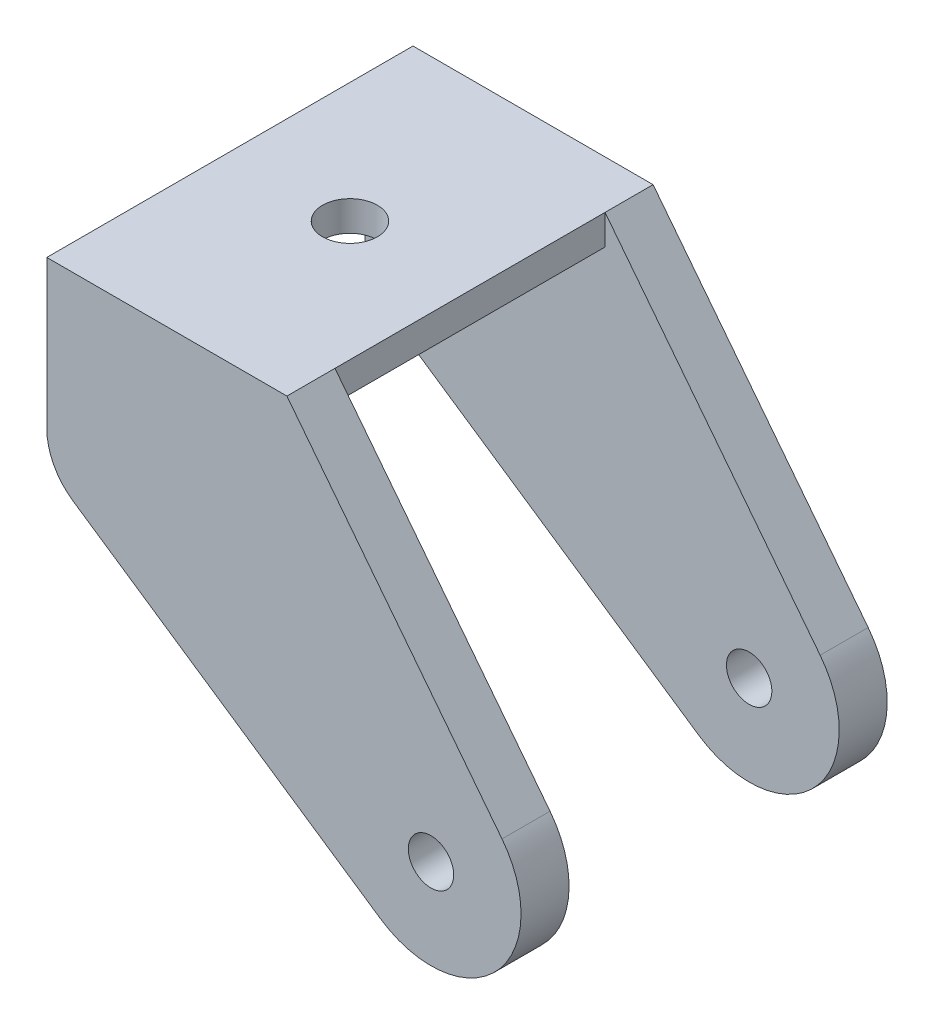
ISO-10303-21;
HEADER;
FILE_DESCRIPTION(('STEP AP214'),'2;1');
FILE_NAME('part.step','',(''),(''),'','','');
FILE_SCHEMA(('AUTOMOTIVE_DESIGN { 1 0 10303 214 1 1 1 1 }'));
ENDSEC;
DATA;
#1=APPLICATION_CONTEXT('core data for automotive mechanical design processes');
#2=APPLICATION_PROTOCOL_DEFINITION('international standard','automotive_design',2000,#1);
#3=PRODUCT_CONTEXT('',#1,'mechanical');
#4=PRODUCT('Part','Part','',(#3));
#5=PRODUCT_RELATED_PRODUCT_CATEGORY('part','',(#4));
#6=PRODUCT_DEFINITION_FORMATION('','',#4);
#7=PRODUCT_DEFINITION_CONTEXT('part definition',#1,'design');
#8=PRODUCT_DEFINITION('design','',#6,#7);
#9=PRODUCT_DEFINITION_SHAPE('','',#8);
#10=(LENGTH_UNIT() NAMED_UNIT(*) SI_UNIT(.MILLI.,.METRE.));
#11=(NAMED_UNIT(*) PLANE_ANGLE_UNIT() SI_UNIT($,.RADIAN.));
#12=(NAMED_UNIT(*) SI_UNIT($,.STERADIAN.) SOLID_ANGLE_UNIT());
#13=UNCERTAINTY_MEASURE_WITH_UNIT(LENGTH_MEASURE(1.E-05),#10,'distance_accuracy_value','');
#14=(GEOMETRIC_REPRESENTATION_CONTEXT(3) GLOBAL_UNCERTAINTY_ASSIGNED_CONTEXT((#13)) GLOBAL_UNIT_ASSIGNED_CONTEXT((#10,
#11,#12)) REPRESENTATION_CONTEXT('',''));
#15=CARTESIAN_POINT('',(0.,0.,0.));
#16=DIRECTION('',(0.,0.,1.));
#17=DIRECTION('',(1.,0.,0.));
#18=AXIS2_PLACEMENT_3D('',#15,#16,#17);
#19=CARTESIAN_POINT('',(7.51306662009443,5.85486592178019,5.08));
#20=DIRECTION('',(0.78877339843511,0.614684086276135,0.));
#21=DIRECTION('',(-0.614684086276135,0.78877339843511,0.));
#22=AXIS2_PLACEMENT_3D('',#19,#20,#21);
#23=PLANE('',#22);
#24=DIRECTION('',(0.614684086276135,-0.78877339843511,0.));
#25=VECTOR('',#24,1.);
#26=CARTESIAN_POINT('',(7.51306662009443,5.85486592178019,0.));
#27=LINE('',#26,#25);
#28=CARTESIAN_POINT('',(-15.24,35.052,0.));
#29=VERTEX_POINT('',#28);
#30=CARTESIAN_POINT('',(7.51306662009443,5.85486592178019,0.));
#31=VERTEX_POINT('',#30);
#32=EDGE_CURVE('E237',#29,#31,#27,.T.);
#33=ORIENTED_EDGE('',*,*,#32,.F.);
#34=DIRECTION('',(0.,0.,-1.));
#35=VECTOR('',#34,1.);
#36=CARTESIAN_POINT('',(-15.24,35.052,5.08));
#37=LINE('',#36,#35);
#38=CARTESIAN_POINT('',(-15.24,35.052,5.08));
#39=VERTEX_POINT('',#38);
#40=EDGE_CURVE('E279',#39,#29,#37,.T.);
#41=ORIENTED_EDGE('',*,*,#40,.F.);
#42=DIRECTION('',(0.614684086276135,-0.78877339843511,0.));
#43=VECTOR('',#42,1.);
#44=CARTESIAN_POINT('',(7.51306662009443,5.85486592178019,5.08));
#45=LINE('',#44,#43);
#46=CARTESIAN_POINT('',(7.51306662009443,5.85486592178019,5.08));
#47=VERTEX_POINT('',#46);
#48=EDGE_CURVE('E238',#39,#47,#45,.T.);
#49=ORIENTED_EDGE('',*,*,#48,.T.);
#50=DIRECTION('',(0.,0.,-1.));
#51=VECTOR('',#50,1.);
#52=CARTESIAN_POINT('',(7.51306662009443,5.85486592178019,5.08));
#53=LINE('',#52,#51);
#54=EDGE_CURVE('E252',#47,#31,#53,.T.);
#55=ORIENTED_EDGE('',*,*,#54,.T.);
#56=EDGE_LOOP('',(#33,#41,#49,#55));
#57=FACE_BOUND('',#56,.T.);
#58=ADVANCED_FACE('F43',(#57),#23,.T.);
#59=CARTESIAN_POINT('',(0.,35.052,5.08));
#60=DIRECTION('',(0.,1.,0.));
#61=DIRECTION('',(-1.,0.,0.));
#62=AXIS2_PLACEMENT_3D('',#59,#60,#61);
#63=PLANE('',#62);
#64=CARTESIAN_POINT('',(-27.94,35.052,19.3675));
#65=DIRECTION('',(0.,1.,0.));
#66=DIRECTION('',(0.,0.,1.));
#67=AXIS2_PLACEMENT_3D('',#64,#65,#66);
#68=CIRCLE('',#67,2.9);
#69=CARTESIAN_POINT('',(-27.94,35.052,22.2675));
#70=VERTEX_POINT('',#69);
#71=EDGE_CURVE('E379',#70,#70,#68,.T.);
#72=ORIENTED_EDGE('',*,*,#71,.F.);
#73=EDGE_LOOP('',(#72));
#74=FACE_BOUND('',#73,.T.);
#75=DIRECTION('',(1.,0.,0.));
#76=VECTOR('',#75,1.);
#77=CARTESIAN_POINT('',(0.,35.052,0.));
#78=LINE('',#77,#76);
#79=CARTESIAN_POINT('',(-40.64,35.052,0.));
#80=VERTEX_POINT('',#79);
#81=EDGE_CURVE('E256',#80,#29,#78,.T.);
#82=ORIENTED_EDGE('',*,*,#81,.F.);
#83=DIRECTION('',(0.,0.,-1.));
#84=VECTOR('',#83,1.);
#85=CARTESIAN_POINT('',(-40.64,35.052,5.08));
#86=LINE('',#85,#84);
#87=CARTESIAN_POINT('',(-40.64,35.052,38.735));
#88=VERTEX_POINT('',#87);
#89=EDGE_CURVE('E276',#88,#80,#86,.T.);
#90=ORIENTED_EDGE('',*,*,#89,.F.);
#91=DIRECTION('',(1.,0.,0.));
#92=VECTOR('',#91,1.);
#93=CARTESIAN_POINT('',(0.,35.052,38.735));
#94=LINE('',#93,#92);
#95=CARTESIAN_POINT('',(-15.24,35.052,38.735));
#96=VERTEX_POINT('',#95);
#97=EDGE_CURVE('E197',#88,#96,#94,.T.);
#98=ORIENTED_EDGE('',*,*,#97,.T.);
#99=DIRECTION('',(0.,0.,1.));
#100=VECTOR('',#99,1.);
#101=CARTESIAN_POINT('',(-15.24,35.052,33.655));
#102=LINE('',#101,#100);
#103=CARTESIAN_POINT('',(-15.24,35.052,33.655));
#104=VERTEX_POINT('',#103);
#105=EDGE_CURVE('E216',#104,#96,#102,.T.);
#106=ORIENTED_EDGE('',*,*,#105,.F.);
#107=DIRECTION('',(0.,0.,-1.));
#108=VECTOR('',#107,1.);
#109=CARTESIAN_POINT('',(-15.24,35.052,19.3675));
#110=LINE('',#109,#108);
#111=EDGE_CURVE('E151',#104,#39,#110,.T.);
#112=ORIENTED_EDGE('',*,*,#111,.T.);
#113=ORIENTED_EDGE('',*,*,#40,.T.);
#114=EDGE_LOOP('',(#82,#90,#98,#106,#112,#113));
#115=FACE_BOUND('',#114,.T.);
#116=ADVANCED_FACE('F324',(#74,#115),#63,.T.);
#117=CARTESIAN_POINT('',(-40.64,0.,5.08));
#118=DIRECTION('',(1.,0.,0.));
#119=DIRECTION('',(0.,0.,-1.));
#120=AXIS2_PLACEMENT_3D('',#117,#118,#119);
#121=PLANE('',#120);
#122=DIRECTION('',(0.,-1.,0.));
#123=VECTOR('',#122,1.);
#124=CARTESIAN_POINT('',(-40.64,0.,33.655));
#125=LINE('',#124,#123);
#126=CARTESIAN_POINT('',(-40.64,31.877,33.655));
#127=VERTEX_POINT('',#126);
#128=CARTESIAN_POINT('',(-40.64,19.3720851606183,33.655));
#129=VERTEX_POINT('',#128);
#130=EDGE_CURVE('E162',#127,#129,#125,.T.);
#131=ORIENTED_EDGE('',*,*,#130,.T.);
#132=DIRECTION('',(0.,0.,1.));
#133=VECTOR('',#132,1.);
#134=CARTESIAN_POINT('',(-40.64,19.3720851606183,5.08));
#135=LINE('',#134,#133);
#136=CARTESIAN_POINT('',(-40.64,19.3720851606183,38.735));
#137=VERTEX_POINT('',#136);
#138=EDGE_CURVE('E285',#129,#137,#135,.T.);
#139=ORIENTED_EDGE('',*,*,#138,.T.);
#140=DIRECTION('',(0.,-1.,0.));
#141=VECTOR('',#140,1.);
#142=CARTESIAN_POINT('',(-40.64,0.,38.735));
#143=LINE('',#142,#141);
#144=EDGE_CURVE('E200',#88,#137,#143,.T.);
#145=ORIENTED_EDGE('',*,*,#144,.F.);
#146=ORIENTED_EDGE('',*,*,#89,.T.);
#147=DIRECTION('',(0.,-1.,0.));
#148=VECTOR('',#147,1.);
#149=CARTESIAN_POINT('',(-40.64,0.,0.));
#150=LINE('',#149,#148);
#151=CARTESIAN_POINT('',(-40.64,19.3720851606183,0.));
#152=VERTEX_POINT('',#151);
#153=EDGE_CURVE('E260',#80,#152,#150,.T.);
#154=ORIENTED_EDGE('',*,*,#153,.T.);
#155=DIRECTION('',(0.,0.,-1.));
#156=VECTOR('',#155,1.);
#157=CARTESIAN_POINT('',(-40.64,19.3720851606183,5.08));
#158=LINE('',#157,#156);
#159=CARTESIAN_POINT('',(-40.64,19.3720851606183,5.08));
#160=VERTEX_POINT('',#159);
#161=EDGE_CURVE('E282',#152,#160,#158,.F.);
#162=ORIENTED_EDGE('',*,*,#161,.T.);
#163=DIRECTION('',(0.,-1.,0.));
#164=VECTOR('',#163,1.);
#165=CARTESIAN_POINT('',(-40.64,0.,5.08));
#166=LINE('',#165,#164);
#167=CARTESIAN_POINT('',(-40.64,31.877,5.08));
#168=VERTEX_POINT('',#167);
#169=EDGE_CURVE('E242',#168,#160,#166,.T.);
#170=ORIENTED_EDGE('',*,*,#169,.F.);
#171=DIRECTION('',(0.,0.,-1.));
#172=VECTOR('',#171,1.);
#173=CARTESIAN_POINT('',(-40.64,31.877,19.3675));
#174=LINE('',#173,#172);
#175=EDGE_CURVE('E150',#127,#168,#174,.T.);
#176=ORIENTED_EDGE('',*,*,#175,.F.);
#177=EDGE_LOOP('',(#131,#139,#145,#146,#154,#162,#170,#176));
#178=FACE_BOUND('',#177,.T.);
#179=ADVANCED_FACE('F308',(#178),#121,.F.);
#180=CARTESIAN_POINT('',(-5.33846771674689,-7.88837039173815,5.08));
#181=DIRECTION('',(0.560469051626971,0.828175369211355,0.));
#182=DIRECTION('',(-0.828175369211355,0.560469051626971,0.));
#183=AXIS2_PLACEMENT_3D('',#180,#181,#182);
#184=PLANE('',#183);
#185=DIRECTION('',(0.828175369211355,-0.560469051626971,0.));
#186=VECTOR('',#185,1.);
#187=CARTESIAN_POINT('',(-5.33846771674689,-7.88837039173815,5.08));
#188=LINE('',#187,#186);
#189=CARTESIAN_POINT('',(-37.8489784778313,14.1131715661262,5.08));
#190=VERTEX_POINT('',#189);
#191=CARTESIAN_POINT('',(-5.33846771674689,-7.88837039173815,5.08));
#192=VERTEX_POINT('',#191);
#193=EDGE_CURVE('E246',#190,#192,#188,.T.);
#194=ORIENTED_EDGE('',*,*,#193,.F.);
#195=DIRECTION('',(0.,0.,-1.));
#196=VECTOR('',#195,1.);
#197=CARTESIAN_POINT('',(-37.8489784778313,14.1131715661262,5.08));
#198=LINE('',#197,#196);
#199=CARTESIAN_POINT('',(-37.8489784778313,14.1131715661262,0.));
#200=VERTEX_POINT('',#199);
#201=EDGE_CURVE('E298',#190,#200,#198,.T.);
#202=ORIENTED_EDGE('',*,*,#201,.T.);
#203=DIRECTION('',(0.828175369211355,-0.560469051626971,0.));
#204=VECTOR('',#203,1.);
#205=CARTESIAN_POINT('',(-5.33846771674689,-7.88837039173815,0.));
#206=LINE('',#205,#204);
#207=CARTESIAN_POINT('',(-5.33846771674689,-7.88837039173815,0.));
#208=VERTEX_POINT('',#207);
#209=EDGE_CURVE('E264',#200,#208,#206,.T.);
#210=ORIENTED_EDGE('',*,*,#209,.T.);
#211=DIRECTION('',(0.,0.,-1.));
#212=VECTOR('',#211,1.);
#213=CARTESIAN_POINT('',(-5.33846771674689,-7.88837039173815,5.08));
#214=LINE('',#213,#212);
#215=EDGE_CURVE('E272',#192,#208,#214,.T.);
#216=ORIENTED_EDGE('',*,*,#215,.F.);
#217=EDGE_LOOP('',(#194,#202,#210,#216));
#218=FACE_BOUND('',#217,.T.);
#219=ADVANCED_FACE('F312',(#218),#184,.F.);
#220=CARTESIAN_POINT('',(0.,0.,5.08));
#221=DIRECTION('',(0.,0.,-1.));
#222=DIRECTION('',(-1.,0.,0.));
#223=AXIS2_PLACEMENT_3D('',#220,#221,#222);
#224=CYLINDRICAL_SURFACE('',#223,9.525);
#225=CARTESIAN_POINT('',(0.,0.,0.));
#226=DIRECTION('',(0.,0.,1.));
#227=DIRECTION('',(1.,0.,0.));
#228=AXIS2_PLACEMENT_3D('',#225,#226,#227);
#229=CIRCLE('',#228,9.525);
#230=EDGE_CURVE('E243',#208,#31,#229,.T.);
#231=ORIENTED_EDGE('',*,*,#230,.T.);
#232=ORIENTED_EDGE('',*,*,#54,.F.);
#233=CARTESIAN_POINT('',(0.,0.,5.08));
#234=DIRECTION('',(0.,0.,1.));
#235=DIRECTION('',(1.,0.,0.));
#236=AXIS2_PLACEMENT_3D('',#233,#234,#235);
#237=CIRCLE('',#236,9.525);
#238=EDGE_CURVE('E249',#192,#47,#237,.T.);
#239=ORIENTED_EDGE('',*,*,#238,.F.);
#240=ORIENTED_EDGE('',*,*,#215,.T.);
#241=EDGE_LOOP('',(#231,#232,#239,#240));
#242=FACE_BOUND('',#241,.T.);
#243=ADVANCED_FACE('F320',(#242),#224,.T.);
#244=CARTESIAN_POINT('',(0.,0.,5.08));
#245=DIRECTION('',(0.,0.,1.));
#246=DIRECTION('',(1.,0.,0.));
#247=AXIS2_PLACEMENT_3D('',#244,#245,#246);
#248=PLANE('',#247);
#249=ORIENTED_EDGE('',*,*,#169,.T.);
#250=CARTESIAN_POINT('',(-34.29,19.3720851606183,5.08));
#251=DIRECTION('',(0.,0.,1.));
#252=DIRECTION('',(1.,0.,0.));
#253=AXIS2_PLACEMENT_3D('',#250,#251,#252);
#254=CIRCLE('',#253,6.35);
#255=EDGE_CURVE('E11',#160,#190,#254,.T.);
#256=ORIENTED_EDGE('',*,*,#255,.T.);
#257=ORIENTED_EDGE('',*,*,#193,.T.);
#258=ORIENTED_EDGE('',*,*,#238,.T.);
#259=ORIENTED_EDGE('',*,*,#48,.F.);
#260=DIRECTION('',(0.,1.,0.));
#261=VECTOR('',#260,1.);
#262=CARTESIAN_POINT('',(-15.24,35.052,5.08));
#263=LINE('',#262,#261);
#264=CARTESIAN_POINT('',(-15.24,31.877,5.08));
#265=VERTEX_POINT('',#264);
#266=EDGE_CURVE('E222',#265,#39,#263,.T.);
#267=ORIENTED_EDGE('',*,*,#266,.F.);
#268=DIRECTION('',(1.,0.,0.));
#269=VECTOR('',#268,1.);
#270=CARTESIAN_POINT('',(-40.64,31.877,5.08));
#271=LINE('',#270,#269);
#272=EDGE_CURVE('E145',#168,#265,#271,.T.);
#273=ORIENTED_EDGE('',*,*,#272,.F.);
#274=EDGE_LOOP('',(#249,#256,#257,#258,#259,#267,#273));
#275=FACE_BOUND('',#274,.T.);
#276=CARTESIAN_POINT('',(0.,0.,5.08));
#277=DIRECTION('',(0.,0.,-1.));
#278=DIRECTION('',(-1.,0.,0.));
#279=AXIS2_PLACEMENT_3D('',#276,#277,#278);
#280=CIRCLE('',#279,2.4);
#281=CARTESIAN_POINT('',(-2.4,0.,5.08));
#282=VERTEX_POINT('',#281);
#283=EDGE_CURVE('E233',#282,#282,#280,.T.);
#284=ORIENTED_EDGE('',*,*,#283,.T.);
#285=EDGE_LOOP('',(#284));
#286=FACE_BOUND('',#285,.T.);
#287=ADVANCED_FACE('F315',(#275,#286),#248,.T.);
#288=CARTESIAN_POINT('',(0.,0.,0.));
#289=DIRECTION('',(0.,0.,1.));
#290=DIRECTION('',(1.,0.,0.));
#291=AXIS2_PLACEMENT_3D('',#288,#289,#290);
#292=PLANE('',#291);
#293=CARTESIAN_POINT('',(0.,0.,0.));
#294=DIRECTION('',(0.,0.,-1.));
#295=DIRECTION('',(-1.,0.,0.));
#296=AXIS2_PLACEMENT_3D('',#293,#294,#295);
#297=CIRCLE('',#296,2.4);
#298=CARTESIAN_POINT('',(-2.4,0.,0.));
#299=VERTEX_POINT('',#298);
#300=EDGE_CURVE('E229',#299,#299,#297,.T.);
#301=ORIENTED_EDGE('',*,*,#300,.F.);
#302=EDGE_LOOP('',(#301));
#303=FACE_BOUND('',#302,.T.);
#304=ORIENTED_EDGE('',*,*,#209,.F.);
#305=CARTESIAN_POINT('',(-34.29,19.3720851606183,0.));
#306=DIRECTION('',(0.,0.,1.));
#307=DIRECTION('',(1.,0.,0.));
#308=AXIS2_PLACEMENT_3D('',#305,#306,#307);
#309=CIRCLE('',#308,6.35);
#310=EDGE_CURVE('E52',#200,#152,#309,.F.);
#311=ORIENTED_EDGE('',*,*,#310,.T.);
#312=ORIENTED_EDGE('',*,*,#153,.F.);
#313=ORIENTED_EDGE('',*,*,#81,.T.);
#314=ORIENTED_EDGE('',*,*,#32,.T.);
#315=ORIENTED_EDGE('',*,*,#230,.F.);
#316=EDGE_LOOP('',(#304,#311,#312,#313,#314,#315));
#317=FACE_BOUND('',#316,.T.);
#318=ADVANCED_FACE('F304',(#303,#317),#292,.F.);
#319=CARTESIAN_POINT('',(0.,0.,0.));
#320=DIRECTION('',(0.,0.,-1.));
#321=DIRECTION('',(-1.,0.,0.));
#322=AXIS2_PLACEMENT_3D('',#319,#320,#321);
#323=CYLINDRICAL_SURFACE('',#322,2.4);
#324=ORIENTED_EDGE('',*,*,#283,.F.);
#325=EDGE_LOOP('',(#324));
#326=FACE_BOUND('',#325,.T.);
#327=ORIENTED_EDGE('',*,*,#300,.T.);
#328=EDGE_LOOP('',(#327));
#329=FACE_BOUND('',#328,.T.);
#330=ADVANCED_FACE('F387',(#326,#329),#323,.F.);
#331=CARTESIAN_POINT('',(-40.64,31.877,19.3675));
#332=DIRECTION('',(0.,1.,0.));
#333=DIRECTION('',(0.,0.,1.));
#334=AXIS2_PLACEMENT_3D('',#331,#332,#333);
#335=PLANE('',#334);
#336=CARTESIAN_POINT('',(-27.94,31.877,19.3675));
#337=DIRECTION('',(0.,1.,0.));
#338=DIRECTION('',(0.,0.,1.));
#339=AXIS2_PLACEMENT_3D('',#336,#337,#338);
#340=CIRCLE('',#339,2.89999999999999);
#341=CARTESIAN_POINT('',(-27.94,31.877,22.2675));
#342=VERTEX_POINT('',#341);
#343=EDGE_CURVE('E164',#342,#342,#340,.T.);
#344=ORIENTED_EDGE('',*,*,#343,.T.);
#345=EDGE_LOOP('',(#344));
#346=FACE_BOUND('',#345,.T.);
#347=ORIENTED_EDGE('',*,*,#272,.T.);
#348=DIRECTION('',(0.,0.,-1.));
#349=VECTOR('',#348,1.);
#350=CARTESIAN_POINT('',(-15.24,31.877,19.3675));
#351=LINE('',#350,#349);
#352=CARTESIAN_POINT('',(-15.24,31.877,33.655));
#353=VERTEX_POINT('',#352);
#354=EDGE_CURVE('E139',#353,#265,#351,.T.);
#355=ORIENTED_EDGE('',*,*,#354,.F.);
#356=DIRECTION('',(1.,0.,0.));
#357=VECTOR('',#356,1.);
#358=CARTESIAN_POINT('',(-40.64,31.877,33.655));
#359=LINE('',#358,#357);
#360=EDGE_CURVE('E143',#127,#353,#359,.T.);
#361=ORIENTED_EDGE('',*,*,#360,.F.);
#362=ORIENTED_EDGE('',*,*,#175,.T.);
#363=EDGE_LOOP('',(#347,#355,#361,#362));
#364=FACE_BOUND('',#363,.T.);
#365=ADVANCED_FACE('F141',(#346,#364),#335,.F.);
#366=CARTESIAN_POINT('',(-15.24,35.052,19.3675));
#367=DIRECTION('',(-1.,0.,0.));
#368=DIRECTION('',(0.,-1.,0.));
#369=AXIS2_PLACEMENT_3D('',#366,#367,#368);
#370=PLANE('',#369);
#371=ORIENTED_EDGE('',*,*,#266,.T.);
#372=ORIENTED_EDGE('',*,*,#111,.F.);
#373=DIRECTION('',(0.,1.,0.));
#374=VECTOR('',#373,1.);
#375=CARTESIAN_POINT('',(-15.24,35.052,33.655));
#376=LINE('',#375,#374);
#377=EDGE_CURVE('E159',#353,#104,#376,.T.);
#378=ORIENTED_EDGE('',*,*,#377,.F.);
#379=ORIENTED_EDGE('',*,*,#354,.T.);
#380=EDGE_LOOP('',(#371,#372,#378,#379));
#381=FACE_BOUND('',#380,.T.);
#382=ADVANCED_FACE('F166',(#381),#370,.F.);
#383=CARTESIAN_POINT('',(7.51306662009443,5.85486592178019,33.655));
#384=DIRECTION('',(0.78877339843511,0.614684086276135,0.));
#385=DIRECTION('',(-0.614684086276135,0.78877339843511,0.));
#386=AXIS2_PLACEMENT_3D('',#383,#384,#385);
#387=PLANE('',#386);
#388=DIRECTION('',(0.614684086276135,-0.78877339843511,0.));
#389=VECTOR('',#388,1.);
#390=CARTESIAN_POINT('',(7.51306662009443,5.85486592178019,38.735));
#391=LINE('',#390,#389);
#392=CARTESIAN_POINT('',(7.51306662009443,5.85486592178019,38.735));
#393=VERTEX_POINT('',#392);
#394=EDGE_CURVE('E180',#96,#393,#391,.T.);
#395=ORIENTED_EDGE('',*,*,#394,.T.);
#396=DIRECTION('',(0.,0.,1.));
#397=VECTOR('',#396,1.);
#398=CARTESIAN_POINT('',(7.51306662009443,5.85486592178019,33.655));
#399=LINE('',#398,#397);
#400=CARTESIAN_POINT('',(7.51306662009443,5.85486592178019,33.655));
#401=VERTEX_POINT('',#400);
#402=EDGE_CURVE('E193',#401,#393,#399,.T.);
#403=ORIENTED_EDGE('',*,*,#402,.F.);
#404=DIRECTION('',(0.614684086276135,-0.78877339843511,0.));
#405=VECTOR('',#404,1.);
#406=CARTESIAN_POINT('',(7.51306662009443,5.85486592178019,33.655));
#407=LINE('',#406,#405);
#408=EDGE_CURVE('E181',#104,#401,#407,.T.);
#409=ORIENTED_EDGE('',*,*,#408,.F.);
#410=ORIENTED_EDGE('',*,*,#105,.T.);
#411=EDGE_LOOP('',(#395,#403,#409,#410));
#412=FACE_BOUND('',#411,.T.);
#413=ADVANCED_FACE('F330',(#412),#387,.T.);
#414=CARTESIAN_POINT('',(-5.33846771674689,-7.88837039173815,33.655));
#415=DIRECTION('',(0.560469051626971,0.828175369211355,0.));
#416=DIRECTION('',(-0.828175369211355,0.560469051626971,0.));
#417=AXIS2_PLACEMENT_3D('',#414,#415,#416);
#418=PLANE('',#417);
#419=DIRECTION('',(0.828175369211355,-0.560469051626971,0.));
#420=VECTOR('',#419,1.);
#421=CARTESIAN_POINT('',(-5.33846771674689,-7.88837039173815,38.735));
#422=LINE('',#421,#420);
#423=CARTESIAN_POINT('',(-37.8489784778313,14.1131715661262,38.735));
#424=VERTEX_POINT('',#423);
#425=CARTESIAN_POINT('',(-5.33846771674689,-7.88837039173815,38.735));
#426=VERTEX_POINT('',#425);
#427=EDGE_CURVE('E204',#424,#426,#422,.T.);
#428=ORIENTED_EDGE('',*,*,#427,.F.);
#429=DIRECTION('',(0.,0.,1.));
#430=VECTOR('',#429,1.);
#431=CARTESIAN_POINT('',(-37.8489784778313,14.1131715661262,33.655));
#432=LINE('',#431,#430);
#433=CARTESIAN_POINT('',(-37.8489784778313,14.1131715661262,33.655));
#434=VERTEX_POINT('',#433);
#435=EDGE_CURVE('E292',#424,#434,#432,.F.);
#436=ORIENTED_EDGE('',*,*,#435,.T.);
#437=DIRECTION('',(0.828175369211355,-0.560469051626971,0.));
#438=VECTOR('',#437,1.);
#439=CARTESIAN_POINT('',(-5.33846771674689,-7.88837039173815,33.655));
#440=LINE('',#439,#438);
#441=CARTESIAN_POINT('',(-5.33846771674689,-7.88837039173815,33.655));
#442=VERTEX_POINT('',#441);
#443=EDGE_CURVE('E187',#434,#442,#440,.T.);
#444=ORIENTED_EDGE('',*,*,#443,.T.);
#445=DIRECTION('',(0.,0.,1.));
#446=VECTOR('',#445,1.);
#447=CARTESIAN_POINT('',(-5.33846771674689,-7.88837039173815,33.655));
#448=LINE('',#447,#446);
#449=EDGE_CURVE('E212',#442,#426,#448,.T.);
#450=ORIENTED_EDGE('',*,*,#449,.T.);
#451=EDGE_LOOP('',(#428,#436,#444,#450));
#452=FACE_BOUND('',#451,.T.);
#453=ADVANCED_FACE('F339',(#452),#418,.F.);
#454=CARTESIAN_POINT('',(0.,0.,33.655));
#455=DIRECTION('',(0.,0.,1.));
#456=DIRECTION('',(-1.,0.,0.));
#457=AXIS2_PLACEMENT_3D('',#454,#455,#456);
#458=CYLINDRICAL_SURFACE('',#457,9.525);
#459=CARTESIAN_POINT('',(0.,0.,38.735));
#460=DIRECTION('',(0.,0.,1.));
#461=DIRECTION('',(1.,0.,0.));
#462=AXIS2_PLACEMENT_3D('',#459,#460,#461);
#463=CIRCLE('',#462,9.525);
#464=EDGE_CURVE('E184',#426,#393,#463,.T.);
#465=ORIENTED_EDGE('',*,*,#464,.F.);
#466=ORIENTED_EDGE('',*,*,#449,.F.);
#467=CARTESIAN_POINT('',(0.,0.,33.655));
#468=DIRECTION('',(0.,0.,1.));
#469=DIRECTION('',(1.,0.,0.));
#470=AXIS2_PLACEMENT_3D('',#467,#468,#469);
#471=CIRCLE('',#470,9.525);
#472=EDGE_CURVE('E190',#442,#401,#471,.T.);
#473=ORIENTED_EDGE('',*,*,#472,.T.);
#474=ORIENTED_EDGE('',*,*,#402,.T.);
#475=EDGE_LOOP('',(#465,#466,#473,#474));
#476=FACE_BOUND('',#475,.T.);
#477=ADVANCED_FACE('F336',(#476),#458,.T.);
#478=CARTESIAN_POINT('',(0.,0.,33.655));
#479=DIRECTION('',(0.,0.,-1.));
#480=DIRECTION('',(1.,0.,0.));
#481=AXIS2_PLACEMENT_3D('',#478,#479,#480);
#482=PLANE('',#481);
#483=ORIENTED_EDGE('',*,*,#443,.F.);
#484=CARTESIAN_POINT('',(-34.29,19.3720851606183,33.655));
#485=DIRECTION('',(0.,0.,-1.));
#486=DIRECTION('',(-1.,0.,0.));
#487=AXIS2_PLACEMENT_3D('',#484,#485,#486);
#488=CIRCLE('',#487,6.35);
#489=EDGE_CURVE('E295',#434,#129,#488,.T.);
#490=ORIENTED_EDGE('',*,*,#489,.T.);
#491=ORIENTED_EDGE('',*,*,#130,.F.);
#492=ORIENTED_EDGE('',*,*,#360,.T.);
#493=ORIENTED_EDGE('',*,*,#377,.T.);
#494=ORIENTED_EDGE('',*,*,#408,.T.);
#495=ORIENTED_EDGE('',*,*,#472,.F.);
#496=EDGE_LOOP('',(#483,#490,#491,#492,#493,#494,#495));
#497=FACE_BOUND('',#496,.T.);
#498=CARTESIAN_POINT('',(0.,0.,33.655));
#499=DIRECTION('',(0.,0.,-1.));
#500=DIRECTION('',(-1.,0.,0.));
#501=AXIS2_PLACEMENT_3D('',#498,#499,#500);
#502=CIRCLE('',#501,2.4);
#503=CARTESIAN_POINT('',(-2.4,0.,33.655));
#504=VERTEX_POINT('',#503);
#505=EDGE_CURVE('E173',#504,#504,#502,.T.);
#506=ORIENTED_EDGE('',*,*,#505,.F.);
#507=EDGE_LOOP('',(#506));
#508=FACE_BOUND('',#507,.T.);
#509=ADVANCED_FACE('F156',(#497,#508),#482,.T.);
#510=CARTESIAN_POINT('',(0.,0.,38.735));
#511=DIRECTION('',(0.,0.,-1.));
#512=DIRECTION('',(1.,0.,0.));
#513=AXIS2_PLACEMENT_3D('',#510,#511,#512);
#514=PLANE('',#513);
#515=CARTESIAN_POINT('',(0.,0.,38.735));
#516=DIRECTION('',(0.,0.,-1.));
#517=DIRECTION('',(-1.,0.,0.));
#518=AXIS2_PLACEMENT_3D('',#515,#516,#517);
#519=CIRCLE('',#518,2.4);
#520=CARTESIAN_POINT('',(-2.4,0.,38.735));
#521=VERTEX_POINT('',#520);
#522=EDGE_CURVE('E169',#521,#521,#519,.T.);
#523=ORIENTED_EDGE('',*,*,#522,.T.);
#524=EDGE_LOOP('',(#523));
#525=FACE_BOUND('',#524,.T.);
#526=ORIENTED_EDGE('',*,*,#144,.T.);
#527=CARTESIAN_POINT('',(-34.29,19.3720851606183,38.735));
#528=DIRECTION('',(0.,0.,-1.));
#529=DIRECTION('',(-1.,0.,0.));
#530=AXIS2_PLACEMENT_3D('',#527,#528,#529);
#531=CIRCLE('',#530,6.35);
#532=EDGE_CURVE('E289',#137,#424,#531,.F.);
#533=ORIENTED_EDGE('',*,*,#532,.T.);
#534=ORIENTED_EDGE('',*,*,#427,.T.);
#535=ORIENTED_EDGE('',*,*,#464,.T.);
#536=ORIENTED_EDGE('',*,*,#394,.F.);
#537=ORIENTED_EDGE('',*,*,#97,.F.);
#538=EDGE_LOOP('',(#526,#533,#534,#535,#536,#537));
#539=FACE_BOUND('',#538,.T.);
#540=ADVANCED_FACE('F345',(#525,#539),#514,.F.);
#541=CARTESIAN_POINT('',(0.,0.,38.735));
#542=DIRECTION('',(0.,0.,1.));
#543=DIRECTION('',(-1.,0.,0.));
#544=AXIS2_PLACEMENT_3D('',#541,#542,#543);
#545=CYLINDRICAL_SURFACE('',#544,2.4);
#546=ORIENTED_EDGE('',*,*,#505,.T.);
#547=EDGE_LOOP('',(#546));
#548=FACE_BOUND('',#547,.T.);
#549=ORIENTED_EDGE('',*,*,#522,.F.);
#550=EDGE_LOOP('',(#549));
#551=FACE_BOUND('',#550,.T.);
#552=ADVANCED_FACE('F347',(#548,#551),#545,.F.);
#553=CARTESIAN_POINT('',(-27.94,35.052,19.3675));
#554=DIRECTION('',(0.,1.,0.));
#555=DIRECTION('',(0.,0.,1.));
#556=AXIS2_PLACEMENT_3D('',#553,#554,#555);
#557=CYLINDRICAL_SURFACE('',#556,2.89999999999999);
#558=ORIENTED_EDGE('',*,*,#71,.T.);
#559=EDGE_LOOP('',(#558));
#560=FACE_BOUND('',#559,.T.);
#561=ORIENTED_EDGE('',*,*,#343,.F.);
#562=EDGE_LOOP('',(#561));
#563=FACE_BOUND('',#562,.T.);
#564=ADVANCED_FACE('F354',(#560,#563),#557,.F.);
#565=CARTESIAN_POINT('',(-34.29,19.3720851606183,5.08));
#566=DIRECTION('',(0.,0.,1.));
#567=DIRECTION('',(1.,0.,0.));
#568=AXIS2_PLACEMENT_3D('',#565,#566,#567);
#569=CYLINDRICAL_SURFACE('',#568,6.35);
#570=ORIENTED_EDGE('',*,*,#489,.F.);
#571=ORIENTED_EDGE('',*,*,#435,.F.);
#572=ORIENTED_EDGE('',*,*,#532,.F.);
#573=ORIENTED_EDGE('',*,*,#138,.F.);
#574=EDGE_LOOP('',(#570,#571,#572,#573));
#575=FACE_BOUND('',#574,.T.);
#576=ADVANCED_FACE('F342',(#575),#569,.T.);
#577=CARTESIAN_POINT('',(-34.29,19.3720851606183,5.08));
#578=DIRECTION('',(0.,0.,-1.));
#579=DIRECTION('',(-1.,0.,0.));
#580=AXIS2_PLACEMENT_3D('',#577,#578,#579);
#581=CYLINDRICAL_SURFACE('',#580,6.35);
#582=ORIENTED_EDGE('',*,*,#255,.F.);
#583=ORIENTED_EDGE('',*,*,#161,.F.);
#584=ORIENTED_EDGE('',*,*,#310,.F.);
#585=ORIENTED_EDGE('',*,*,#201,.F.);
#586=EDGE_LOOP('',(#582,#583,#584,#585));
#587=FACE_BOUND('',#586,.T.);
#588=ADVANCED_FACE('F45',(#587),#581,.T.);
#589=CLOSED_SHELL('',(#58,#116,#179,#219,#243,#287,#318,#330,#365,#382,#413,#453,#477,#509,#540,
#552,#564,#576,#588));
#590=MANIFOLD_SOLID_BREP('B2',#589);
#591=ADVANCED_BREP_SHAPE_REPRESENTATION('',(#18,#590),#14);
#592=SHAPE_DEFINITION_REPRESENTATION(#9,#591);
ENDSEC;
END-ISO-10303-21;
